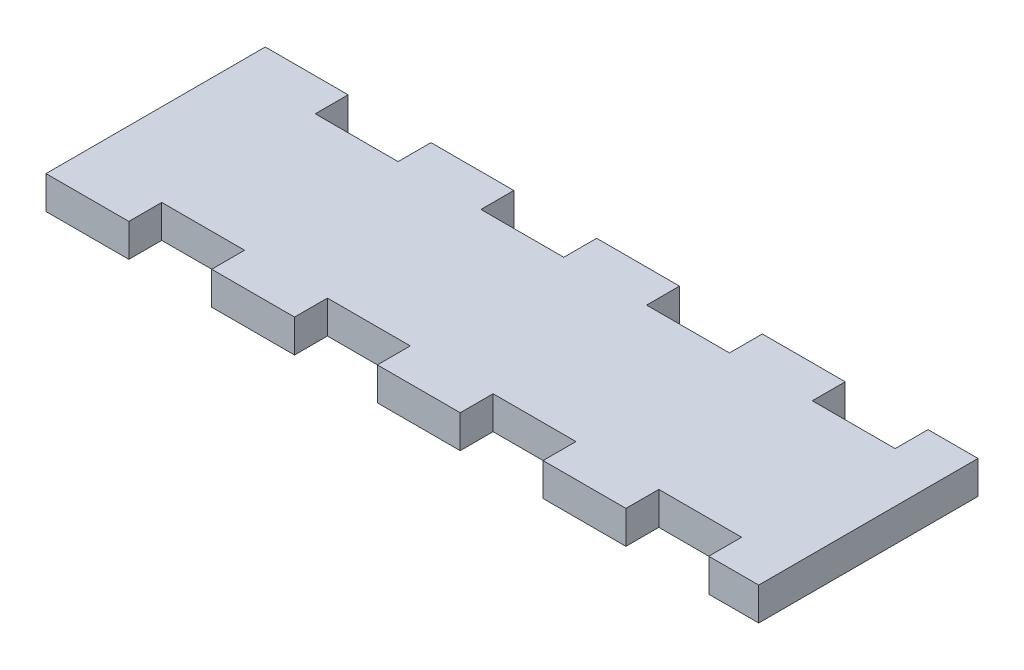
ISO-10303-21;
HEADER;
FILE_DESCRIPTION(('STEP AP214'),'2;1');
FILE_NAME('part.step','',(''),(''),'','','');
FILE_SCHEMA(('AUTOMOTIVE_DESIGN { 1 0 10303 214 1 1 1 1 }'));
ENDSEC;
DATA;
#1=APPLICATION_CONTEXT('core data for automotive mechanical design processes');
#2=APPLICATION_PROTOCOL_DEFINITION('international standard','automotive_design',2000,#1);
#3=PRODUCT_CONTEXT('',#1,'mechanical');
#4=PRODUCT('Part','Part','',(#3));
#5=PRODUCT_RELATED_PRODUCT_CATEGORY('part','',(#4));
#6=PRODUCT_DEFINITION_FORMATION('','',#4);
#7=PRODUCT_DEFINITION_CONTEXT('part definition',#1,'design');
#8=PRODUCT_DEFINITION('design','',#6,#7);
#9=PRODUCT_DEFINITION_SHAPE('','',#8);
#10=(LENGTH_UNIT() NAMED_UNIT(*) SI_UNIT(.MILLI.,.METRE.));
#11=(NAMED_UNIT(*) PLANE_ANGLE_UNIT() SI_UNIT($,.RADIAN.));
#12=(NAMED_UNIT(*) SI_UNIT($,.STERADIAN.) SOLID_ANGLE_UNIT());
#13=UNCERTAINTY_MEASURE_WITH_UNIT(LENGTH_MEASURE(1.E-05),#10,'distance_accuracy_value','');
#14=(GEOMETRIC_REPRESENTATION_CONTEXT(3) GLOBAL_UNCERTAINTY_ASSIGNED_CONTEXT((#13)) GLOBAL_UNIT_ASSIGNED_CONTEXT((#10,
#11,#12)) REPRESENTATION_CONTEXT('',''));
#15=CARTESIAN_POINT('',(0.,0.,0.));
#16=DIRECTION('',(0.,0.,1.));
#17=DIRECTION('',(1.,0.,0.));
#18=AXIS2_PLACEMENT_3D('',#15,#16,#17);
#19=CARTESIAN_POINT('',(0.,3.,0.));
#20=DIRECTION('',(1.,0.,0.));
#21=DIRECTION('',(0.,0.,-1.));
#22=AXIS2_PLACEMENT_3D('',#19,#20,#21);
#23=PLANE('',#22);
#24=DIRECTION('',(0.,0.,1.));
#25=VECTOR('',#24,1.);
#26=CARTESIAN_POINT('',(0.,0.,0.));
#27=LINE('',#26,#25);
#28=CARTESIAN_POINT('',(0.,0.,-20.));
#29=VERTEX_POINT('',#28);
#30=CARTESIAN_POINT('',(0.,0.,0.));
#31=VERTEX_POINT('',#30);
#32=EDGE_CURVE('E296',#29,#31,#27,.T.);
#33=ORIENTED_EDGE('',*,*,#32,.T.);
#34=DIRECTION('',(0.,-1.,0.));
#35=VECTOR('',#34,1.);
#36=CARTESIAN_POINT('',(0.,3.,0.));
#37=LINE('',#36,#35);
#38=CARTESIAN_POINT('',(0.,3.,0.));
#39=VERTEX_POINT('',#38);
#40=EDGE_CURVE('E11',#39,#31,#37,.T.);
#41=ORIENTED_EDGE('',*,*,#40,.F.);
#42=DIRECTION('',(0.,0.,1.));
#43=VECTOR('',#42,1.);
#44=CARTESIAN_POINT('',(0.,3.,0.));
#45=LINE('',#44,#43);
#46=CARTESIAN_POINT('',(0.,3.,-20.));
#47=VERTEX_POINT('',#46);
#48=EDGE_CURVE('E366',#47,#39,#45,.T.);
#49=ORIENTED_EDGE('',*,*,#48,.F.);
#50=DIRECTION('',(0.,-1.,0.));
#51=VECTOR('',#50,1.);
#52=CARTESIAN_POINT('',(0.,3.,-20.));
#53=LINE('',#52,#51);
#54=EDGE_CURVE('E292',#47,#29,#53,.T.);
#55=ORIENTED_EDGE('',*,*,#54,.T.);
#56=EDGE_LOOP('',(#33,#41,#49,#55));
#57=FACE_BOUND('',#56,.T.);
#58=ADVANCED_FACE('F32',(#57),#23,.F.);
#59=CARTESIAN_POINT('',(0.,3.,0.));
#60=DIRECTION('',(0.,0.,-1.));
#61=DIRECTION('',(-1.,0.,0.));
#62=AXIS2_PLACEMENT_3D('',#59,#60,#61);
#63=PLANE('',#62);
#64=DIRECTION('',(1.,0.,0.));
#65=VECTOR('',#64,1.);
#66=CARTESIAN_POINT('',(0.,0.,0.));
#67=LINE('',#66,#65);
#68=CARTESIAN_POINT('',(7.55599199999998,0.,0.));
#69=VERTEX_POINT('',#68);
#70=EDGE_CURVE('E299',#31,#69,#67,.T.);
#71=ORIENTED_EDGE('',*,*,#70,.T.);
#72=DIRECTION('',(0.,-1.,0.));
#73=VECTOR('',#72,1.);
#74=CARTESIAN_POINT('',(7.55599199999998,3.,0.));
#75=LINE('',#74,#73);
#76=CARTESIAN_POINT('',(7.55599199999998,3.,0.));
#77=VERTEX_POINT('',#76);
#78=EDGE_CURVE('E40',#77,#69,#75,.T.);
#79=ORIENTED_EDGE('',*,*,#78,.F.);
#80=DIRECTION('',(1.,0.,0.));
#81=VECTOR('',#80,1.);
#82=CARTESIAN_POINT('',(0.,3.,0.));
#83=LINE('',#82,#81);
#84=EDGE_CURVE('E175',#39,#77,#83,.T.);
#85=ORIENTED_EDGE('',*,*,#84,.F.);
#86=ORIENTED_EDGE('',*,*,#40,.T.);
#87=EDGE_LOOP('',(#71,#79,#85,#86));
#88=FACE_BOUND('',#87,.T.);
#89=ADVANCED_FACE('F564',(#88),#63,.F.);
#90=CARTESIAN_POINT('',(7.55599199999998,3.,-2.99999399999999));
#91=DIRECTION('',(-1.,0.,0.));
#92=DIRECTION('',(0.,0.,1.));
#93=AXIS2_PLACEMENT_3D('',#90,#91,#92);
#94=PLANE('',#93);
#95=DIRECTION('',(0.,0.,-1.));
#96=VECTOR('',#95,1.);
#97=CARTESIAN_POINT('',(7.55599199999998,0.,-2.99999399999999));
#98=LINE('',#97,#96);
#99=CARTESIAN_POINT('',(7.55599199999998,0.,-2.99999399999999));
#100=VERTEX_POINT('',#99);
#101=EDGE_CURVE('E301',#69,#100,#98,.T.);
#102=ORIENTED_EDGE('',*,*,#101,.T.);
#103=DIRECTION('',(0.,-1.,0.));
#104=VECTOR('',#103,1.);
#105=CARTESIAN_POINT('',(7.55599199999998,3.,-2.99999399999999));
#106=LINE('',#105,#104);
#107=CARTESIAN_POINT('',(7.55599199999998,3.,-2.99999399999999));
#108=VERTEX_POINT('',#107);
#109=EDGE_CURVE('E457',#108,#100,#106,.T.);
#110=ORIENTED_EDGE('',*,*,#109,.F.);
#111=DIRECTION('',(0.,0.,-1.));
#112=VECTOR('',#111,1.);
#113=CARTESIAN_POINT('',(7.55599199999998,3.,-2.99999399999999));
#114=LINE('',#113,#112);
#115=EDGE_CURVE('E465',#77,#108,#114,.T.);
#116=ORIENTED_EDGE('',*,*,#115,.F.);
#117=ORIENTED_EDGE('',*,*,#78,.T.);
#118=EDGE_LOOP('',(#102,#110,#116,#117));
#119=FACE_BOUND('',#118,.T.);
#120=ADVANCED_FACE('F463',(#119),#94,.F.);
#121=CARTESIAN_POINT('',(7.55599199999998,3.,-2.99999399999999));
#122=DIRECTION('',(0.,0.,-1.));
#123=DIRECTION('',(-1.,0.,0.));
#124=AXIS2_PLACEMENT_3D('',#121,#122,#123);
#125=PLANE('',#124);
#126=DIRECTION('',(1.,0.,0.));
#127=VECTOR('',#126,1.);
#128=CARTESIAN_POINT('',(7.55599199999998,0.,-2.99999399999999));
#129=LINE('',#128,#127);
#130=CARTESIAN_POINT('',(15.11173,0.,-2.99999399999999));
#131=VERTEX_POINT('',#130);
#132=EDGE_CURVE('E303',#100,#131,#129,.T.);
#133=ORIENTED_EDGE('',*,*,#132,.T.);
#134=DIRECTION('',(0.,-1.,0.));
#135=VECTOR('',#134,1.);
#136=CARTESIAN_POINT('',(15.11173,3.,-2.99999399999999));
#137=LINE('',#136,#135);
#138=CARTESIAN_POINT('',(15.11173,3.,-2.99999399999999));
#139=VERTEX_POINT('',#138);
#140=EDGE_CURVE('E454',#139,#131,#137,.T.);
#141=ORIENTED_EDGE('',*,*,#140,.F.);
#142=DIRECTION('',(1.,0.,0.));
#143=VECTOR('',#142,1.);
#144=CARTESIAN_POINT('',(7.55599199999998,3.,-2.99999399999999));
#145=LINE('',#144,#143);
#146=EDGE_CURVE('E483',#108,#139,#145,.T.);
#147=ORIENTED_EDGE('',*,*,#146,.F.);
#148=ORIENTED_EDGE('',*,*,#109,.T.);
#149=EDGE_LOOP('',(#133,#141,#147,#148));
#150=FACE_BOUND('',#149,.T.);
#151=ADVANCED_FACE('F474',(#150),#125,.F.);
#152=CARTESIAN_POINT('',(15.11173,3.,-2.99999399999999));
#153=DIRECTION('',(1.,0.,0.));
#154=DIRECTION('',(0.,0.,-1.));
#155=AXIS2_PLACEMENT_3D('',#152,#153,#154);
#156=PLANE('',#155);
#157=DIRECTION('',(0.,0.,1.));
#158=VECTOR('',#157,1.);
#159=CARTESIAN_POINT('',(15.11173,0.,-2.99999399999999));
#160=LINE('',#159,#158);
#161=CARTESIAN_POINT('',(15.11173,0.,0.));
#162=VERTEX_POINT('',#161);
#163=EDGE_CURVE('E305',#131,#162,#160,.T.);
#164=ORIENTED_EDGE('',*,*,#163,.T.);
#165=DIRECTION('',(0.,-1.,0.));
#166=VECTOR('',#165,1.);
#167=CARTESIAN_POINT('',(15.11173,3.,0.));
#168=LINE('',#167,#166);
#169=CARTESIAN_POINT('',(15.11173,3.,0.));
#170=VERTEX_POINT('',#169);
#171=EDGE_CURVE('E451',#170,#162,#168,.T.);
#172=ORIENTED_EDGE('',*,*,#171,.F.);
#173=DIRECTION('',(0.,0.,1.));
#174=VECTOR('',#173,1.);
#175=CARTESIAN_POINT('',(15.11173,3.,-2.99999399999999));
#176=LINE('',#175,#174);
#177=EDGE_CURVE('E480',#139,#170,#176,.T.);
#178=ORIENTED_EDGE('',*,*,#177,.F.);
#179=ORIENTED_EDGE('',*,*,#140,.T.);
#180=EDGE_LOOP('',(#164,#172,#178,#179));
#181=FACE_BOUND('',#180,.T.);
#182=ADVANCED_FACE('F478',(#181),#156,.F.);
#183=CARTESIAN_POINT('',(15.11173,3.,0.));
#184=DIRECTION('',(0.,0.,-1.));
#185=DIRECTION('',(-1.,0.,0.));
#186=AXIS2_PLACEMENT_3D('',#183,#184,#185);
#187=PLANE('',#186);
#188=DIRECTION('',(1.,0.,0.));
#189=VECTOR('',#188,1.);
#190=CARTESIAN_POINT('',(15.11173,0.,0.));
#191=LINE('',#190,#189);
#192=CARTESIAN_POINT('',(22.667468,0.,0.));
#193=VERTEX_POINT('',#192);
#194=EDGE_CURVE('E307',#162,#193,#191,.T.);
#195=ORIENTED_EDGE('',*,*,#194,.T.);
#196=DIRECTION('',(0.,-1.,0.));
#197=VECTOR('',#196,1.);
#198=CARTESIAN_POINT('',(22.667468,3.,0.));
#199=LINE('',#198,#197);
#200=CARTESIAN_POINT('',(22.667468,3.,0.));
#201=VERTEX_POINT('',#200);
#202=EDGE_CURVE('E448',#201,#193,#199,.T.);
#203=ORIENTED_EDGE('',*,*,#202,.F.);
#204=DIRECTION('',(1.,0.,0.));
#205=VECTOR('',#204,1.);
#206=CARTESIAN_POINT('',(15.11173,3.,0.));
#207=LINE('',#206,#205);
#208=EDGE_CURVE('E482',#170,#201,#207,.T.);
#209=ORIENTED_EDGE('',*,*,#208,.F.);
#210=ORIENTED_EDGE('',*,*,#171,.T.);
#211=EDGE_LOOP('',(#195,#203,#209,#210));
#212=FACE_BOUND('',#211,.T.);
#213=ADVANCED_FACE('F577',(#212),#187,.F.);
#214=CARTESIAN_POINT('',(22.667468,3.,-2.99999399999999));
#215=DIRECTION('',(-1.,0.,0.));
#216=DIRECTION('',(0.,0.,1.));
#217=AXIS2_PLACEMENT_3D('',#214,#215,#216);
#218=PLANE('',#217);
#219=DIRECTION('',(0.,0.,-1.));
#220=VECTOR('',#219,1.);
#221=CARTESIAN_POINT('',(22.667468,0.,-2.99999399999999));
#222=LINE('',#221,#220);
#223=CARTESIAN_POINT('',(22.667468,0.,-2.99999399999999));
#224=VERTEX_POINT('',#223);
#225=EDGE_CURVE('E309',#193,#224,#222,.T.);
#226=ORIENTED_EDGE('',*,*,#225,.T.);
#227=DIRECTION('',(0.,-1.,0.));
#228=VECTOR('',#227,1.);
#229=CARTESIAN_POINT('',(22.667468,3.,-2.99999399999999));
#230=LINE('',#229,#228);
#231=CARTESIAN_POINT('',(22.667468,3.,-2.99999399999999));
#232=VERTEX_POINT('',#231);
#233=EDGE_CURVE('E445',#232,#224,#230,.T.);
#234=ORIENTED_EDGE('',*,*,#233,.F.);
#235=DIRECTION('',(0.,0.,-1.));
#236=VECTOR('',#235,1.);
#237=CARTESIAN_POINT('',(22.667468,3.,-2.99999399999999));
#238=LINE('',#237,#236);
#239=EDGE_CURVE('E485',#201,#232,#238,.T.);
#240=ORIENTED_EDGE('',*,*,#239,.F.);
#241=ORIENTED_EDGE('',*,*,#202,.T.);
#242=EDGE_LOOP('',(#226,#234,#240,#241));
#243=FACE_BOUND('',#242,.T.);
#244=ADVANCED_FACE('F580',(#243),#218,.F.);
#245=CARTESIAN_POINT('',(22.667468,3.,-2.99999399999999));
#246=DIRECTION('',(0.,0.,-1.));
#247=DIRECTION('',(-1.,0.,0.));
#248=AXIS2_PLACEMENT_3D('',#245,#246,#247);
#249=PLANE('',#248);
#250=DIRECTION('',(1.,0.,0.));
#251=VECTOR('',#250,1.);
#252=CARTESIAN_POINT('',(22.667468,0.,-2.99999399999999));
#253=LINE('',#252,#251);
#254=CARTESIAN_POINT('',(30.221936,0.,-2.99999399999999));
#255=VERTEX_POINT('',#254);
#256=EDGE_CURVE('E311',#224,#255,#253,.T.);
#257=ORIENTED_EDGE('',*,*,#256,.T.);
#258=DIRECTION('',(0.,-1.,0.));
#259=VECTOR('',#258,1.);
#260=CARTESIAN_POINT('',(30.221936,3.,-2.99999399999999));
#261=LINE('',#260,#259);
#262=CARTESIAN_POINT('',(30.221936,3.,-2.99999399999999));
#263=VERTEX_POINT('',#262);
#264=EDGE_CURVE('E442',#263,#255,#261,.T.);
#265=ORIENTED_EDGE('',*,*,#264,.F.);
#266=DIRECTION('',(1.,0.,0.));
#267=VECTOR('',#266,1.);
#268=CARTESIAN_POINT('',(22.667468,3.,-2.99999399999999));
#269=LINE('',#268,#267);
#270=EDGE_CURVE('E491',#232,#263,#269,.T.);
#271=ORIENTED_EDGE('',*,*,#270,.F.);
#272=ORIENTED_EDGE('',*,*,#233,.T.);
#273=EDGE_LOOP('',(#257,#265,#271,#272));
#274=FACE_BOUND('',#273,.T.);
#275=ADVANCED_FACE('F584',(#274),#249,.F.);
#276=CARTESIAN_POINT('',(30.221936,3.,-2.99999399999999));
#277=DIRECTION('',(1.,0.,0.));
#278=DIRECTION('',(0.,0.,-1.));
#279=AXIS2_PLACEMENT_3D('',#276,#277,#278);
#280=PLANE('',#279);
#281=DIRECTION('',(0.,0.,1.));
#282=VECTOR('',#281,1.);
#283=CARTESIAN_POINT('',(30.221936,0.,-2.99999399999999));
#284=LINE('',#283,#282);
#285=CARTESIAN_POINT('',(30.221936,0.,0.));
#286=VERTEX_POINT('',#285);
#287=EDGE_CURVE('E313',#255,#286,#284,.T.);
#288=ORIENTED_EDGE('',*,*,#287,.T.);
#289=DIRECTION('',(0.,-1.,0.));
#290=VECTOR('',#289,1.);
#291=CARTESIAN_POINT('',(30.221936,3.,0.));
#292=LINE('',#291,#290);
#293=CARTESIAN_POINT('',(30.221936,3.,0.));
#294=VERTEX_POINT('',#293);
#295=EDGE_CURVE('E439',#294,#286,#292,.T.);
#296=ORIENTED_EDGE('',*,*,#295,.F.);
#297=DIRECTION('',(0.,0.,1.));
#298=VECTOR('',#297,1.);
#299=CARTESIAN_POINT('',(30.221936,3.,-2.99999399999999));
#300=LINE('',#299,#298);
#301=EDGE_CURVE('E493',#263,#294,#300,.T.);
#302=ORIENTED_EDGE('',*,*,#301,.F.);
#303=ORIENTED_EDGE('',*,*,#264,.T.);
#304=EDGE_LOOP('',(#288,#296,#302,#303));
#305=FACE_BOUND('',#304,.T.);
#306=ADVANCED_FACE('F588',(#305),#280,.F.);
#307=CARTESIAN_POINT('',(30.221936,3.,0.));
#308=DIRECTION('',(0.,0.,-1.));
#309=DIRECTION('',(-1.,0.,0.));
#310=AXIS2_PLACEMENT_3D('',#307,#308,#309);
#311=PLANE('',#310);
#312=DIRECTION('',(1.,0.,0.));
#313=VECTOR('',#312,1.);
#314=CARTESIAN_POINT('',(30.221936,0.,0.));
#315=LINE('',#314,#313);
#316=CARTESIAN_POINT('',(37.777674,0.,0.));
#317=VERTEX_POINT('',#316);
#318=EDGE_CURVE('E315',#286,#317,#315,.T.);
#319=ORIENTED_EDGE('',*,*,#318,.T.);
#320=DIRECTION('',(0.,-1.,0.));
#321=VECTOR('',#320,1.);
#322=CARTESIAN_POINT('',(37.777674,3.,0.));
#323=LINE('',#322,#321);
#324=CARTESIAN_POINT('',(37.777674,3.,0.));
#325=VERTEX_POINT('',#324);
#326=EDGE_CURVE('E436',#325,#317,#323,.T.);
#327=ORIENTED_EDGE('',*,*,#326,.F.);
#328=DIRECTION('',(1.,0.,0.));
#329=VECTOR('',#328,1.);
#330=CARTESIAN_POINT('',(30.221936,3.,0.));
#331=LINE('',#330,#329);
#332=EDGE_CURVE('E495',#294,#325,#331,.T.);
#333=ORIENTED_EDGE('',*,*,#332,.F.);
#334=ORIENTED_EDGE('',*,*,#295,.T.);
#335=EDGE_LOOP('',(#319,#327,#333,#334));
#336=FACE_BOUND('',#335,.T.);
#337=ADVANCED_FACE('F592',(#336),#311,.F.);
#338=CARTESIAN_POINT('',(37.777674,3.,-2.99999399999999));
#339=DIRECTION('',(-1.,0.,0.));
#340=DIRECTION('',(0.,0.,1.));
#341=AXIS2_PLACEMENT_3D('',#338,#339,#340);
#342=PLANE('',#341);
#343=DIRECTION('',(0.,0.,-1.));
#344=VECTOR('',#343,1.);
#345=CARTESIAN_POINT('',(37.777674,0.,-2.99999399999999));
#346=LINE('',#345,#344);
#347=CARTESIAN_POINT('',(37.777674,0.,-2.99999399999999));
#348=VERTEX_POINT('',#347);
#349=EDGE_CURVE('E317',#317,#348,#346,.T.);
#350=ORIENTED_EDGE('',*,*,#349,.T.);
#351=DIRECTION('',(0.,-1.,0.));
#352=VECTOR('',#351,1.);
#353=CARTESIAN_POINT('',(37.777674,3.,-2.99999399999999));
#354=LINE('',#353,#352);
#355=CARTESIAN_POINT('',(37.777674,3.,-2.99999399999999));
#356=VERTEX_POINT('',#355);
#357=EDGE_CURVE('E433',#356,#348,#354,.T.);
#358=ORIENTED_EDGE('',*,*,#357,.F.);
#359=DIRECTION('',(0.,0.,-1.));
#360=VECTOR('',#359,1.);
#361=CARTESIAN_POINT('',(37.777674,3.,-2.99999399999999));
#362=LINE('',#361,#360);
#363=EDGE_CURVE('E497',#325,#356,#362,.T.);
#364=ORIENTED_EDGE('',*,*,#363,.F.);
#365=ORIENTED_EDGE('',*,*,#326,.T.);
#366=EDGE_LOOP('',(#350,#358,#364,#365));
#367=FACE_BOUND('',#366,.T.);
#368=ADVANCED_FACE('F596',(#367),#342,.F.);
#369=CARTESIAN_POINT('',(37.777674,3.,-2.99999399999999));
#370=DIRECTION('',(0.,0.,-1.));
#371=DIRECTION('',(-1.,0.,0.));
#372=AXIS2_PLACEMENT_3D('',#369,#370,#371);
#373=PLANE('',#372);
#374=DIRECTION('',(1.,0.,0.));
#375=VECTOR('',#374,1.);
#376=CARTESIAN_POINT('',(37.777674,0.,-2.99999399999999));
#377=LINE('',#376,#375);
#378=CARTESIAN_POINT('',(45.333412,0.,-2.99999399999999));
#379=VERTEX_POINT('',#378);
#380=EDGE_CURVE('E319',#348,#379,#377,.T.);
#381=ORIENTED_EDGE('',*,*,#380,.T.);
#382=DIRECTION('',(0.,-1.,0.));
#383=VECTOR('',#382,1.);
#384=CARTESIAN_POINT('',(45.333412,3.,-2.99999399999999));
#385=LINE('',#384,#383);
#386=CARTESIAN_POINT('',(45.333412,3.,-2.99999399999999));
#387=VERTEX_POINT('',#386);
#388=EDGE_CURVE('E430',#387,#379,#385,.T.);
#389=ORIENTED_EDGE('',*,*,#388,.F.);
#390=DIRECTION('',(1.,0.,0.));
#391=VECTOR('',#390,1.);
#392=CARTESIAN_POINT('',(37.777674,3.,-2.99999399999999));
#393=LINE('',#392,#391);
#394=EDGE_CURVE('E499',#356,#387,#393,.T.);
#395=ORIENTED_EDGE('',*,*,#394,.F.);
#396=ORIENTED_EDGE('',*,*,#357,.T.);
#397=EDGE_LOOP('',(#381,#389,#395,#396));
#398=FACE_BOUND('',#397,.T.);
#399=ADVANCED_FACE('F600',(#398),#373,.F.);
#400=CARTESIAN_POINT('',(45.333412,3.,-2.99999399999999));
#401=DIRECTION('',(1.,0.,0.));
#402=DIRECTION('',(0.,0.,-1.));
#403=AXIS2_PLACEMENT_3D('',#400,#401,#402);
#404=PLANE('',#403);
#405=DIRECTION('',(0.,0.,1.));
#406=VECTOR('',#405,1.);
#407=CARTESIAN_POINT('',(45.333412,0.,-2.99999399999999));
#408=LINE('',#407,#406);
#409=CARTESIAN_POINT('',(45.333412,0.,0.));
#410=VERTEX_POINT('',#409);
#411=EDGE_CURVE('E321',#379,#410,#408,.T.);
#412=ORIENTED_EDGE('',*,*,#411,.T.);
#413=DIRECTION('',(0.,-1.,0.));
#414=VECTOR('',#413,1.);
#415=CARTESIAN_POINT('',(45.333412,3.,0.));
#416=LINE('',#415,#414);
#417=CARTESIAN_POINT('',(45.333412,3.,0.));
#418=VERTEX_POINT('',#417);
#419=EDGE_CURVE('E427',#418,#410,#416,.T.);
#420=ORIENTED_EDGE('',*,*,#419,.F.);
#421=DIRECTION('',(0.,0.,1.));
#422=VECTOR('',#421,1.);
#423=CARTESIAN_POINT('',(45.333412,3.,-2.99999399999999));
#424=LINE('',#423,#422);
#425=EDGE_CURVE('E501',#387,#418,#424,.T.);
#426=ORIENTED_EDGE('',*,*,#425,.F.);
#427=ORIENTED_EDGE('',*,*,#388,.T.);
#428=EDGE_LOOP('',(#412,#420,#426,#427));
#429=FACE_BOUND('',#428,.T.);
#430=ADVANCED_FACE('F604',(#429),#404,.F.);
#431=CARTESIAN_POINT('',(45.333412,3.,0.));
#432=DIRECTION('',(0.,0.,-1.));
#433=DIRECTION('',(-1.,0.,0.));
#434=AXIS2_PLACEMENT_3D('',#431,#432,#433);
#435=PLANE('',#434);
#436=DIRECTION('',(1.,0.,0.));
#437=VECTOR('',#436,1.);
#438=CARTESIAN_POINT('',(45.333412,0.,0.));
#439=LINE('',#438,#437);
#440=CARTESIAN_POINT('',(52.88915,0.,0.));
#441=VERTEX_POINT('',#440);
#442=EDGE_CURVE('E323',#410,#441,#439,.T.);
#443=ORIENTED_EDGE('',*,*,#442,.T.);
#444=DIRECTION('',(0.,-1.,0.));
#445=VECTOR('',#444,1.);
#446=CARTESIAN_POINT('',(52.88915,3.,0.));
#447=LINE('',#446,#445);
#448=CARTESIAN_POINT('',(52.88915,3.,0.));
#449=VERTEX_POINT('',#448);
#450=EDGE_CURVE('E424',#449,#441,#447,.T.);
#451=ORIENTED_EDGE('',*,*,#450,.F.);
#452=DIRECTION('',(1.,0.,0.));
#453=VECTOR('',#452,1.);
#454=CARTESIAN_POINT('',(45.333412,3.,0.));
#455=LINE('',#454,#453);
#456=EDGE_CURVE('E503',#418,#449,#455,.T.);
#457=ORIENTED_EDGE('',*,*,#456,.F.);
#458=ORIENTED_EDGE('',*,*,#419,.T.);
#459=EDGE_LOOP('',(#443,#451,#457,#458));
#460=FACE_BOUND('',#459,.T.);
#461=ADVANCED_FACE('F608',(#460),#435,.F.);
#462=CARTESIAN_POINT('',(52.88915,3.,-2.99999399999999));
#463=DIRECTION('',(-1.,0.,0.));
#464=DIRECTION('',(0.,0.,1.));
#465=AXIS2_PLACEMENT_3D('',#462,#463,#464);
#466=PLANE('',#465);
#467=DIRECTION('',(0.,0.,-1.));
#468=VECTOR('',#467,1.);
#469=CARTESIAN_POINT('',(52.88915,0.,-2.99999399999999));
#470=LINE('',#469,#468);
#471=CARTESIAN_POINT('',(52.88915,0.,-2.99999399999999));
#472=VERTEX_POINT('',#471);
#473=EDGE_CURVE('E325',#441,#472,#470,.T.);
#474=ORIENTED_EDGE('',*,*,#473,.T.);
#475=DIRECTION('',(0.,-1.,0.));
#476=VECTOR('',#475,1.);
#477=CARTESIAN_POINT('',(52.88915,3.,-2.99999399999999));
#478=LINE('',#477,#476);
#479=CARTESIAN_POINT('',(52.88915,3.,-2.99999399999999));
#480=VERTEX_POINT('',#479);
#481=EDGE_CURVE('E421',#480,#472,#478,.T.);
#482=ORIENTED_EDGE('',*,*,#481,.F.);
#483=DIRECTION('',(0.,0.,-1.));
#484=VECTOR('',#483,1.);
#485=CARTESIAN_POINT('',(52.88915,3.,-2.99999399999999));
#486=LINE('',#485,#484);
#487=EDGE_CURVE('E505',#449,#480,#486,.T.);
#488=ORIENTED_EDGE('',*,*,#487,.F.);
#489=ORIENTED_EDGE('',*,*,#450,.T.);
#490=EDGE_LOOP('',(#474,#482,#488,#489));
#491=FACE_BOUND('',#490,.T.);
#492=ADVANCED_FACE('F612',(#491),#466,.F.);
#493=CARTESIAN_POINT('',(52.88915,3.,-2.99999399999999));
#494=DIRECTION('',(0.,0.,-1.));
#495=DIRECTION('',(-1.,0.,0.));
#496=AXIS2_PLACEMENT_3D('',#493,#494,#495);
#497=PLANE('',#496);
#498=DIRECTION('',(1.,0.,0.));
#499=VECTOR('',#498,1.);
#500=CARTESIAN_POINT('',(52.88915,0.,-2.99999399999999));
#501=LINE('',#500,#499);
#502=CARTESIAN_POINT('',(60.444634,0.,-2.99999399999999));
#503=VERTEX_POINT('',#502);
#504=EDGE_CURVE('E327',#472,#503,#501,.T.);
#505=ORIENTED_EDGE('',*,*,#504,.T.);
#506=DIRECTION('',(0.,-1.,0.));
#507=VECTOR('',#506,1.);
#508=CARTESIAN_POINT('',(60.444634,3.,-2.99999399999999));
#509=LINE('',#508,#507);
#510=CARTESIAN_POINT('',(60.444634,3.,-2.99999399999999));
#511=VERTEX_POINT('',#510);
#512=EDGE_CURVE('E418',#511,#503,#509,.T.);
#513=ORIENTED_EDGE('',*,*,#512,.F.);
#514=DIRECTION('',(1.,0.,0.));
#515=VECTOR('',#514,1.);
#516=CARTESIAN_POINT('',(52.88915,3.,-2.99999399999999));
#517=LINE('',#516,#515);
#518=EDGE_CURVE('E507',#480,#511,#517,.T.);
#519=ORIENTED_EDGE('',*,*,#518,.F.);
#520=ORIENTED_EDGE('',*,*,#481,.T.);
#521=EDGE_LOOP('',(#505,#513,#519,#520));
#522=FACE_BOUND('',#521,.T.);
#523=ADVANCED_FACE('F616',(#522),#497,.F.);
#524=CARTESIAN_POINT('',(60.444634,3.,-2.99999399999999));
#525=DIRECTION('',(1.,0.,0.));
#526=DIRECTION('',(0.,0.,-1.));
#527=AXIS2_PLACEMENT_3D('',#524,#525,#526);
#528=PLANE('',#527);
#529=DIRECTION('',(0.,0.,1.));
#530=VECTOR('',#529,1.);
#531=CARTESIAN_POINT('',(60.444634,0.,-2.99999399999999));
#532=LINE('',#531,#530);
#533=CARTESIAN_POINT('',(60.444634,0.,0.));
#534=VERTEX_POINT('',#533);
#535=EDGE_CURVE('E329',#503,#534,#532,.T.);
#536=ORIENTED_EDGE('',*,*,#535,.T.);
#537=DIRECTION('',(0.,-1.,0.));
#538=VECTOR('',#537,1.);
#539=CARTESIAN_POINT('',(60.444634,3.,0.));
#540=LINE('',#539,#538);
#541=CARTESIAN_POINT('',(60.444634,3.,0.));
#542=VERTEX_POINT('',#541);
#543=EDGE_CURVE('E415',#542,#534,#540,.T.);
#544=ORIENTED_EDGE('',*,*,#543,.F.);
#545=DIRECTION('',(0.,0.,1.));
#546=VECTOR('',#545,1.);
#547=CARTESIAN_POINT('',(60.444634,3.,-2.99999399999999));
#548=LINE('',#547,#546);
#549=EDGE_CURVE('E509',#511,#542,#548,.T.);
#550=ORIENTED_EDGE('',*,*,#549,.F.);
#551=ORIENTED_EDGE('',*,*,#512,.T.);
#552=EDGE_LOOP('',(#536,#544,#550,#551));
#553=FACE_BOUND('',#552,.T.);
#554=ADVANCED_FACE('F620',(#553),#528,.F.);
#555=CARTESIAN_POINT('',(60.444634,3.,0.));
#556=DIRECTION('',(0.,0.,-1.));
#557=DIRECTION('',(-1.,0.,0.));
#558=AXIS2_PLACEMENT_3D('',#555,#556,#557);
#559=PLANE('',#558);
#560=DIRECTION('',(1.,0.,0.));
#561=VECTOR('',#560,1.);
#562=CARTESIAN_POINT('',(60.444634,0.,0.));
#563=LINE('',#562,#561);
#564=CARTESIAN_POINT('',(65.000886,0.,0.));
#565=VERTEX_POINT('',#564);
#566=EDGE_CURVE('E331',#534,#565,#563,.T.);
#567=ORIENTED_EDGE('',*,*,#566,.T.);
#568=DIRECTION('',(0.,-1.,0.));
#569=VECTOR('',#568,1.);
#570=CARTESIAN_POINT('',(65.000886,3.,0.));
#571=LINE('',#570,#569);
#572=CARTESIAN_POINT('',(65.000886,3.,0.));
#573=VERTEX_POINT('',#572);
#574=EDGE_CURVE('E412',#573,#565,#571,.T.);
#575=ORIENTED_EDGE('',*,*,#574,.F.);
#576=DIRECTION('',(1.,0.,0.));
#577=VECTOR('',#576,1.);
#578=CARTESIAN_POINT('',(60.444634,3.,0.));
#579=LINE('',#578,#577);
#580=EDGE_CURVE('E511',#542,#573,#579,.T.);
#581=ORIENTED_EDGE('',*,*,#580,.F.);
#582=ORIENTED_EDGE('',*,*,#543,.T.);
#583=EDGE_LOOP('',(#567,#575,#581,#582));
#584=FACE_BOUND('',#583,.T.);
#585=ADVANCED_FACE('F624',(#584),#559,.F.);
#586=CARTESIAN_POINT('',(65.000886,3.,0.));
#587=DIRECTION('',(-1.,0.,0.));
#588=DIRECTION('',(0.,0.,1.));
#589=AXIS2_PLACEMENT_3D('',#586,#587,#588);
#590=PLANE('',#589);
#591=DIRECTION('',(0.,0.,-1.));
#592=VECTOR('',#591,1.);
#593=CARTESIAN_POINT('',(65.000886,0.,0.));
#594=LINE('',#593,#592);
#595=CARTESIAN_POINT('',(65.000886,0.,-20.));
#596=VERTEX_POINT('',#595);
#597=EDGE_CURVE('E333',#565,#596,#594,.T.);
#598=ORIENTED_EDGE('',*,*,#597,.T.);
#599=DIRECTION('',(0.,-1.,0.));
#600=VECTOR('',#599,1.);
#601=CARTESIAN_POINT('',(65.000886,3.,-20.));
#602=LINE('',#601,#600);
#603=CARTESIAN_POINT('',(65.000886,3.,-20.));
#604=VERTEX_POINT('',#603);
#605=EDGE_CURVE('E409',#604,#596,#602,.T.);
#606=ORIENTED_EDGE('',*,*,#605,.F.);
#607=DIRECTION('',(0.,0.,-1.));
#608=VECTOR('',#607,1.);
#609=CARTESIAN_POINT('',(65.000886,3.,0.));
#610=LINE('',#609,#608);
#611=EDGE_CURVE('E513',#573,#604,#610,.T.);
#612=ORIENTED_EDGE('',*,*,#611,.F.);
#613=ORIENTED_EDGE('',*,*,#574,.T.);
#614=EDGE_LOOP('',(#598,#606,#612,#613));
#615=FACE_BOUND('',#614,.T.);
#616=ADVANCED_FACE('F628',(#615),#590,.F.);
#617=CARTESIAN_POINT('',(60.444634,3.,-20.));
#618=DIRECTION('',(0.,0.,1.));
#619=DIRECTION('',(1.,0.,0.));
#620=AXIS2_PLACEMENT_3D('',#617,#618,#619);
#621=PLANE('',#620);
#622=DIRECTION('',(-1.,0.,0.));
#623=VECTOR('',#622,1.);
#624=CARTESIAN_POINT('',(60.444634,0.,-20.));
#625=LINE('',#624,#623);
#626=CARTESIAN_POINT('',(60.444634,0.,-20.));
#627=VERTEX_POINT('',#626);
#628=EDGE_CURVE('E335',#596,#627,#625,.T.);
#629=ORIENTED_EDGE('',*,*,#628,.T.);
#630=DIRECTION('',(0.,-1.,0.));
#631=VECTOR('',#630,1.);
#632=CARTESIAN_POINT('',(60.444634,3.,-20.));
#633=LINE('',#632,#631);
#634=CARTESIAN_POINT('',(60.444634,3.,-20.));
#635=VERTEX_POINT('',#634);
#636=EDGE_CURVE('E406',#635,#627,#633,.T.);
#637=ORIENTED_EDGE('',*,*,#636,.F.);
#638=DIRECTION('',(-1.,0.,0.));
#639=VECTOR('',#638,1.);
#640=CARTESIAN_POINT('',(60.444634,3.,-20.));
#641=LINE('',#640,#639);
#642=EDGE_CURVE('E515',#604,#635,#641,.T.);
#643=ORIENTED_EDGE('',*,*,#642,.F.);
#644=ORIENTED_EDGE('',*,*,#605,.T.);
#645=EDGE_LOOP('',(#629,#637,#643,#644));
#646=FACE_BOUND('',#645,.T.);
#647=ADVANCED_FACE('F632',(#646),#621,.F.);
#648=CARTESIAN_POINT('',(60.444634,3.,-20.));
#649=DIRECTION('',(1.,0.,0.));
#650=DIRECTION('',(0.,0.,-1.));
#651=AXIS2_PLACEMENT_3D('',#648,#649,#650);
#652=PLANE('',#651);
#653=DIRECTION('',(0.,0.,1.));
#654=VECTOR('',#653,1.);
#655=CARTESIAN_POINT('',(60.444634,0.,-20.));
#656=LINE('',#655,#654);
#657=CARTESIAN_POINT('',(60.444634,0.,-17.000006));
#658=VERTEX_POINT('',#657);
#659=EDGE_CURVE('E337',#627,#658,#656,.T.);
#660=ORIENTED_EDGE('',*,*,#659,.T.);
#661=DIRECTION('',(0.,-1.,0.));
#662=VECTOR('',#661,1.);
#663=CARTESIAN_POINT('',(60.444634,3.,-17.000006));
#664=LINE('',#663,#662);
#665=CARTESIAN_POINT('',(60.444634,3.,-17.000006));
#666=VERTEX_POINT('',#665);
#667=EDGE_CURVE('E403',#666,#658,#664,.T.);
#668=ORIENTED_EDGE('',*,*,#667,.F.);
#669=DIRECTION('',(0.,0.,1.));
#670=VECTOR('',#669,1.);
#671=CARTESIAN_POINT('',(60.444634,3.,-20.));
#672=LINE('',#671,#670);
#673=EDGE_CURVE('E517',#635,#666,#672,.T.);
#674=ORIENTED_EDGE('',*,*,#673,.F.);
#675=ORIENTED_EDGE('',*,*,#636,.T.);
#676=EDGE_LOOP('',(#660,#668,#674,#675));
#677=FACE_BOUND('',#676,.T.);
#678=ADVANCED_FACE('F636',(#677),#652,.F.);
#679=CARTESIAN_POINT('',(52.88915,3.,-17.000006));
#680=DIRECTION('',(0.,0.,1.));
#681=DIRECTION('',(1.,0.,0.));
#682=AXIS2_PLACEMENT_3D('',#679,#680,#681);
#683=PLANE('',#682);
#684=DIRECTION('',(-1.,0.,0.));
#685=VECTOR('',#684,1.);
#686=CARTESIAN_POINT('',(52.88915,0.,-17.000006));
#687=LINE('',#686,#685);
#688=CARTESIAN_POINT('',(52.88915,0.,-17.000006));
#689=VERTEX_POINT('',#688);
#690=EDGE_CURVE('E339',#658,#689,#687,.T.);
#691=ORIENTED_EDGE('',*,*,#690,.T.);
#692=DIRECTION('',(0.,-1.,0.));
#693=VECTOR('',#692,1.);
#694=CARTESIAN_POINT('',(52.88915,3.,-17.000006));
#695=LINE('',#694,#693);
#696=CARTESIAN_POINT('',(52.88915,3.,-17.000006));
#697=VERTEX_POINT('',#696);
#698=EDGE_CURVE('E400',#697,#689,#695,.T.);
#699=ORIENTED_EDGE('',*,*,#698,.F.);
#700=DIRECTION('',(-1.,0.,0.));
#701=VECTOR('',#700,1.);
#702=CARTESIAN_POINT('',(52.88915,3.,-17.000006));
#703=LINE('',#702,#701);
#704=EDGE_CURVE('E519',#666,#697,#703,.T.);
#705=ORIENTED_EDGE('',*,*,#704,.F.);
#706=ORIENTED_EDGE('',*,*,#667,.T.);
#707=EDGE_LOOP('',(#691,#699,#705,#706));
#708=FACE_BOUND('',#707,.T.);
#709=ADVANCED_FACE('F640',(#708),#683,.F.);
#710=CARTESIAN_POINT('',(52.88915,3.,-20.));
#711=DIRECTION('',(-1.,0.,0.));
#712=DIRECTION('',(0.,0.,1.));
#713=AXIS2_PLACEMENT_3D('',#710,#711,#712);
#714=PLANE('',#713);
#715=DIRECTION('',(0.,0.,-1.));
#716=VECTOR('',#715,1.);
#717=CARTESIAN_POINT('',(52.88915,0.,-20.));
#718=LINE('',#717,#716);
#719=CARTESIAN_POINT('',(52.88915,0.,-20.));
#720=VERTEX_POINT('',#719);
#721=EDGE_CURVE('E341',#689,#720,#718,.T.);
#722=ORIENTED_EDGE('',*,*,#721,.T.);
#723=DIRECTION('',(0.,-1.,0.));
#724=VECTOR('',#723,1.);
#725=CARTESIAN_POINT('',(52.88915,3.,-20.));
#726=LINE('',#725,#724);
#727=CARTESIAN_POINT('',(52.88915,3.,-20.));
#728=VERTEX_POINT('',#727);
#729=EDGE_CURVE('E397',#728,#720,#726,.T.);
#730=ORIENTED_EDGE('',*,*,#729,.F.);
#731=DIRECTION('',(0.,0.,-1.));
#732=VECTOR('',#731,1.);
#733=CARTESIAN_POINT('',(52.88915,3.,-20.));
#734=LINE('',#733,#732);
#735=EDGE_CURVE('E521',#697,#728,#734,.T.);
#736=ORIENTED_EDGE('',*,*,#735,.F.);
#737=ORIENTED_EDGE('',*,*,#698,.T.);
#738=EDGE_LOOP('',(#722,#730,#736,#737));
#739=FACE_BOUND('',#738,.T.);
#740=ADVANCED_FACE('F644',(#739),#714,.F.);
#741=CARTESIAN_POINT('',(45.333412,3.,-20.));
#742=DIRECTION('',(0.,0.,1.));
#743=DIRECTION('',(1.,0.,0.));
#744=AXIS2_PLACEMENT_3D('',#741,#742,#743);
#745=PLANE('',#744);
#746=DIRECTION('',(-1.,0.,0.));
#747=VECTOR('',#746,1.);
#748=CARTESIAN_POINT('',(45.333412,0.,-20.));
#749=LINE('',#748,#747);
#750=CARTESIAN_POINT('',(45.333412,0.,-20.));
#751=VERTEX_POINT('',#750);
#752=EDGE_CURVE('E343',#720,#751,#749,.T.);
#753=ORIENTED_EDGE('',*,*,#752,.T.);
#754=DIRECTION('',(0.,-1.,0.));
#755=VECTOR('',#754,1.);
#756=CARTESIAN_POINT('',(45.333412,3.,-20.));
#757=LINE('',#756,#755);
#758=CARTESIAN_POINT('',(45.333412,3.,-20.));
#759=VERTEX_POINT('',#758);
#760=EDGE_CURVE('E394',#759,#751,#757,.T.);
#761=ORIENTED_EDGE('',*,*,#760,.F.);
#762=DIRECTION('',(-1.,0.,0.));
#763=VECTOR('',#762,1.);
#764=CARTESIAN_POINT('',(45.333412,3.,-20.));
#765=LINE('',#764,#763);
#766=EDGE_CURVE('E523',#728,#759,#765,.T.);
#767=ORIENTED_EDGE('',*,*,#766,.F.);
#768=ORIENTED_EDGE('',*,*,#729,.T.);
#769=EDGE_LOOP('',(#753,#761,#767,#768));
#770=FACE_BOUND('',#769,.T.);
#771=ADVANCED_FACE('F648',(#770),#745,.F.);
#772=CARTESIAN_POINT('',(45.333412,3.,-20.));
#773=DIRECTION('',(1.,0.,0.));
#774=DIRECTION('',(0.,0.,-1.));
#775=AXIS2_PLACEMENT_3D('',#772,#773,#774);
#776=PLANE('',#775);
#777=DIRECTION('',(0.,0.,1.));
#778=VECTOR('',#777,1.);
#779=CARTESIAN_POINT('',(45.333412,0.,-20.));
#780=LINE('',#779,#778);
#781=CARTESIAN_POINT('',(45.333412,0.,-17.000006));
#782=VERTEX_POINT('',#781);
#783=EDGE_CURVE('E345',#751,#782,#780,.T.);
#784=ORIENTED_EDGE('',*,*,#783,.T.);
#785=DIRECTION('',(0.,-1.,0.));
#786=VECTOR('',#785,1.);
#787=CARTESIAN_POINT('',(45.333412,3.,-17.000006));
#788=LINE('',#787,#786);
#789=CARTESIAN_POINT('',(45.333412,3.,-17.000006));
#790=VERTEX_POINT('',#789);
#791=EDGE_CURVE('E391',#790,#782,#788,.T.);
#792=ORIENTED_EDGE('',*,*,#791,.F.);
#793=DIRECTION('',(0.,0.,1.));
#794=VECTOR('',#793,1.);
#795=CARTESIAN_POINT('',(45.333412,3.,-20.));
#796=LINE('',#795,#794);
#797=EDGE_CURVE('E525',#759,#790,#796,.T.);
#798=ORIENTED_EDGE('',*,*,#797,.F.);
#799=ORIENTED_EDGE('',*,*,#760,.T.);
#800=EDGE_LOOP('',(#784,#792,#798,#799));
#801=FACE_BOUND('',#800,.T.);
#802=ADVANCED_FACE('F652',(#801),#776,.F.);
#803=CARTESIAN_POINT('',(37.777674,3.,-17.000006));
#804=DIRECTION('',(0.,0.,1.));
#805=DIRECTION('',(1.,0.,0.));
#806=AXIS2_PLACEMENT_3D('',#803,#804,#805);
#807=PLANE('',#806);
#808=DIRECTION('',(-1.,0.,0.));
#809=VECTOR('',#808,1.);
#810=CARTESIAN_POINT('',(37.777674,0.,-17.000006));
#811=LINE('',#810,#809);
#812=CARTESIAN_POINT('',(37.777674,0.,-17.000006));
#813=VERTEX_POINT('',#812);
#814=EDGE_CURVE('E347',#782,#813,#811,.T.);
#815=ORIENTED_EDGE('',*,*,#814,.T.);
#816=DIRECTION('',(0.,-1.,0.));
#817=VECTOR('',#816,1.);
#818=CARTESIAN_POINT('',(37.777674,3.,-17.000006));
#819=LINE('',#818,#817);
#820=CARTESIAN_POINT('',(37.777674,3.,-17.000006));
#821=VERTEX_POINT('',#820);
#822=EDGE_CURVE('E388',#821,#813,#819,.T.);
#823=ORIENTED_EDGE('',*,*,#822,.F.);
#824=DIRECTION('',(-1.,0.,0.));
#825=VECTOR('',#824,1.);
#826=CARTESIAN_POINT('',(37.777674,3.,-17.000006));
#827=LINE('',#826,#825);
#828=EDGE_CURVE('E527',#790,#821,#827,.T.);
#829=ORIENTED_EDGE('',*,*,#828,.F.);
#830=ORIENTED_EDGE('',*,*,#791,.T.);
#831=EDGE_LOOP('',(#815,#823,#829,#830));
#832=FACE_BOUND('',#831,.T.);
#833=ADVANCED_FACE('F656',(#832),#807,.F.);
#834=CARTESIAN_POINT('',(37.777674,3.,-20.));
#835=DIRECTION('',(-1.,0.,0.));
#836=DIRECTION('',(0.,0.,1.));
#837=AXIS2_PLACEMENT_3D('',#834,#835,#836);
#838=PLANE('',#837);
#839=DIRECTION('',(0.,0.,-1.));
#840=VECTOR('',#839,1.);
#841=CARTESIAN_POINT('',(37.777674,0.,-20.));
#842=LINE('',#841,#840);
#843=CARTESIAN_POINT('',(37.777674,0.,-20.));
#844=VERTEX_POINT('',#843);
#845=EDGE_CURVE('E349',#813,#844,#842,.T.);
#846=ORIENTED_EDGE('',*,*,#845,.T.);
#847=DIRECTION('',(0.,-1.,0.));
#848=VECTOR('',#847,1.);
#849=CARTESIAN_POINT('',(37.777674,3.,-20.));
#850=LINE('',#849,#848);
#851=CARTESIAN_POINT('',(37.777674,3.,-20.));
#852=VERTEX_POINT('',#851);
#853=EDGE_CURVE('E385',#852,#844,#850,.T.);
#854=ORIENTED_EDGE('',*,*,#853,.F.);
#855=DIRECTION('',(0.,0.,-1.));
#856=VECTOR('',#855,1.);
#857=CARTESIAN_POINT('',(37.777674,3.,-20.));
#858=LINE('',#857,#856);
#859=EDGE_CURVE('E529',#821,#852,#858,.T.);
#860=ORIENTED_EDGE('',*,*,#859,.F.);
#861=ORIENTED_EDGE('',*,*,#822,.T.);
#862=EDGE_LOOP('',(#846,#854,#860,#861));
#863=FACE_BOUND('',#862,.T.);
#864=ADVANCED_FACE('F660',(#863),#838,.F.);
#865=CARTESIAN_POINT('',(30.221936,3.,-20.));
#866=DIRECTION('',(0.,0.,1.));
#867=DIRECTION('',(1.,0.,0.));
#868=AXIS2_PLACEMENT_3D('',#865,#866,#867);
#869=PLANE('',#868);
#870=DIRECTION('',(-1.,0.,0.));
#871=VECTOR('',#870,1.);
#872=CARTESIAN_POINT('',(30.221936,0.,-20.));
#873=LINE('',#872,#871);
#874=CARTESIAN_POINT('',(30.221936,0.,-20.));
#875=VERTEX_POINT('',#874);
#876=EDGE_CURVE('E351',#844,#875,#873,.T.);
#877=ORIENTED_EDGE('',*,*,#876,.T.);
#878=DIRECTION('',(0.,-1.,0.));
#879=VECTOR('',#878,1.);
#880=CARTESIAN_POINT('',(30.221936,3.,-20.));
#881=LINE('',#880,#879);
#882=CARTESIAN_POINT('',(30.221936,3.,-20.));
#883=VERTEX_POINT('',#882);
#884=EDGE_CURVE('E382',#883,#875,#881,.T.);
#885=ORIENTED_EDGE('',*,*,#884,.F.);
#886=DIRECTION('',(-1.,0.,0.));
#887=VECTOR('',#886,1.);
#888=CARTESIAN_POINT('',(30.221936,3.,-20.));
#889=LINE('',#888,#887);
#890=EDGE_CURVE('E531',#852,#883,#889,.T.);
#891=ORIENTED_EDGE('',*,*,#890,.F.);
#892=ORIENTED_EDGE('',*,*,#853,.T.);
#893=EDGE_LOOP('',(#877,#885,#891,#892));
#894=FACE_BOUND('',#893,.T.);
#895=ADVANCED_FACE('F664',(#894),#869,.F.);
#896=CARTESIAN_POINT('',(30.221936,3.,-20.));
#897=DIRECTION('',(1.,0.,0.));
#898=DIRECTION('',(0.,0.,-1.));
#899=AXIS2_PLACEMENT_3D('',#896,#897,#898);
#900=PLANE('',#899);
#901=DIRECTION('',(0.,0.,1.));
#902=VECTOR('',#901,1.);
#903=CARTESIAN_POINT('',(30.221936,0.,-20.));
#904=LINE('',#903,#902);
#905=CARTESIAN_POINT('',(30.221936,0.,-17.000006));
#906=VERTEX_POINT('',#905);
#907=EDGE_CURVE('E353',#875,#906,#904,.T.);
#908=ORIENTED_EDGE('',*,*,#907,.T.);
#909=DIRECTION('',(0.,-1.,0.));
#910=VECTOR('',#909,1.);
#911=CARTESIAN_POINT('',(30.221936,3.,-17.000006));
#912=LINE('',#911,#910);
#913=CARTESIAN_POINT('',(30.221936,3.,-17.000006));
#914=VERTEX_POINT('',#913);
#915=EDGE_CURVE('E379',#914,#906,#912,.T.);
#916=ORIENTED_EDGE('',*,*,#915,.F.);
#917=DIRECTION('',(0.,0.,1.));
#918=VECTOR('',#917,1.);
#919=CARTESIAN_POINT('',(30.221936,3.,-20.));
#920=LINE('',#919,#918);
#921=EDGE_CURVE('E533',#883,#914,#920,.T.);
#922=ORIENTED_EDGE('',*,*,#921,.F.);
#923=ORIENTED_EDGE('',*,*,#884,.T.);
#924=EDGE_LOOP('',(#908,#916,#922,#923));
#925=FACE_BOUND('',#924,.T.);
#926=ADVANCED_FACE('F668',(#925),#900,.F.);
#927=CARTESIAN_POINT('',(22.667468,3.,-17.000006));
#928=DIRECTION('',(0.,0.,1.));
#929=DIRECTION('',(1.,0.,0.));
#930=AXIS2_PLACEMENT_3D('',#927,#928,#929);
#931=PLANE('',#930);
#932=DIRECTION('',(-1.,0.,0.));
#933=VECTOR('',#932,1.);
#934=CARTESIAN_POINT('',(22.667468,0.,-17.000006));
#935=LINE('',#934,#933);
#936=CARTESIAN_POINT('',(22.667468,0.,-17.000006));
#937=VERTEX_POINT('',#936);
#938=EDGE_CURVE('E355',#906,#937,#935,.T.);
#939=ORIENTED_EDGE('',*,*,#938,.T.);
#940=DIRECTION('',(0.,-1.,0.));
#941=VECTOR('',#940,1.);
#942=CARTESIAN_POINT('',(22.667468,3.,-17.000006));
#943=LINE('',#942,#941);
#944=CARTESIAN_POINT('',(22.667468,3.,-17.000006));
#945=VERTEX_POINT('',#944);
#946=EDGE_CURVE('E376',#945,#937,#943,.T.);
#947=ORIENTED_EDGE('',*,*,#946,.F.);
#948=DIRECTION('',(-1.,0.,0.));
#949=VECTOR('',#948,1.);
#950=CARTESIAN_POINT('',(22.667468,3.,-17.000006));
#951=LINE('',#950,#949);
#952=EDGE_CURVE('E535',#914,#945,#951,.T.);
#953=ORIENTED_EDGE('',*,*,#952,.F.);
#954=ORIENTED_EDGE('',*,*,#915,.T.);
#955=EDGE_LOOP('',(#939,#947,#953,#954));
#956=FACE_BOUND('',#955,.T.);
#957=ADVANCED_FACE('F672',(#956),#931,.F.);
#958=CARTESIAN_POINT('',(22.667468,3.,-20.));
#959=DIRECTION('',(-1.,0.,0.));
#960=DIRECTION('',(0.,0.,1.));
#961=AXIS2_PLACEMENT_3D('',#958,#959,#960);
#962=PLANE('',#961);
#963=DIRECTION('',(0.,0.,-1.));
#964=VECTOR('',#963,1.);
#965=CARTESIAN_POINT('',(22.667468,0.,-20.));
#966=LINE('',#965,#964);
#967=CARTESIAN_POINT('',(22.667468,0.,-20.));
#968=VERTEX_POINT('',#967);
#969=EDGE_CURVE('E357',#937,#968,#966,.T.);
#970=ORIENTED_EDGE('',*,*,#969,.T.);
#971=DIRECTION('',(0.,-1.,0.));
#972=VECTOR('',#971,1.);
#973=CARTESIAN_POINT('',(22.667468,3.,-20.));
#974=LINE('',#973,#972);
#975=CARTESIAN_POINT('',(22.667468,3.,-20.));
#976=VERTEX_POINT('',#975);
#977=EDGE_CURVE('E373',#976,#968,#974,.T.);
#978=ORIENTED_EDGE('',*,*,#977,.F.);
#979=DIRECTION('',(0.,0.,-1.));
#980=VECTOR('',#979,1.);
#981=CARTESIAN_POINT('',(22.667468,3.,-20.));
#982=LINE('',#981,#980);
#983=EDGE_CURVE('E537',#945,#976,#982,.T.);
#984=ORIENTED_EDGE('',*,*,#983,.F.);
#985=ORIENTED_EDGE('',*,*,#946,.T.);
#986=EDGE_LOOP('',(#970,#978,#984,#985));
#987=FACE_BOUND('',#986,.T.);
#988=ADVANCED_FACE('F676',(#987),#962,.F.);
#989=CARTESIAN_POINT('',(15.11173,3.,-20.));
#990=DIRECTION('',(0.,0.,1.));
#991=DIRECTION('',(1.,0.,0.));
#992=AXIS2_PLACEMENT_3D('',#989,#990,#991);
#993=PLANE('',#992);
#994=DIRECTION('',(-1.,0.,0.));
#995=VECTOR('',#994,1.);
#996=CARTESIAN_POINT('',(15.11173,0.,-20.));
#997=LINE('',#996,#995);
#998=CARTESIAN_POINT('',(15.11173,0.,-20.));
#999=VERTEX_POINT('',#998);
#1000=EDGE_CURVE('E359',#968,#999,#997,.T.);
#1001=ORIENTED_EDGE('',*,*,#1000,.T.);
#1002=DIRECTION('',(0.,-1.,0.));
#1003=VECTOR('',#1002,1.);
#1004=CARTESIAN_POINT('',(15.11173,3.,-20.));
#1005=LINE('',#1004,#1003);
#1006=CARTESIAN_POINT('',(15.11173,3.,-20.));
#1007=VERTEX_POINT('',#1006);
#1008=EDGE_CURVE('E370',#1007,#999,#1005,.T.);
#1009=ORIENTED_EDGE('',*,*,#1008,.F.);
#1010=DIRECTION('',(-1.,0.,0.));
#1011=VECTOR('',#1010,1.);
#1012=CARTESIAN_POINT('',(15.11173,3.,-20.));
#1013=LINE('',#1012,#1011);
#1014=EDGE_CURVE('E539',#976,#1007,#1013,.T.);
#1015=ORIENTED_EDGE('',*,*,#1014,.F.);
#1016=ORIENTED_EDGE('',*,*,#977,.T.);
#1017=EDGE_LOOP('',(#1001,#1009,#1015,#1016));
#1018=FACE_BOUND('',#1017,.T.);
#1019=ADVANCED_FACE('F545',(#1018),#993,.F.);
#1020=CARTESIAN_POINT('',(15.11173,3.,-20.));
#1021=DIRECTION('',(1.,0.,0.));
#1022=DIRECTION('',(0.,0.,-1.));
#1023=AXIS2_PLACEMENT_3D('',#1020,#1021,#1022);
#1024=PLANE('',#1023);
#1025=DIRECTION('',(0.,0.,1.));
#1026=VECTOR('',#1025,1.);
#1027=CARTESIAN_POINT('',(15.11173,0.,-20.));
#1028=LINE('',#1027,#1026);
#1029=CARTESIAN_POINT('',(15.11173,0.,-17.000006));
#1030=VERTEX_POINT('',#1029);
#1031=EDGE_CURVE('E361',#999,#1030,#1028,.T.);
#1032=ORIENTED_EDGE('',*,*,#1031,.T.);
#1033=DIRECTION('',(0.,-1.,0.));
#1034=VECTOR('',#1033,1.);
#1035=CARTESIAN_POINT('',(15.11173,3.,-17.000006));
#1036=LINE('',#1035,#1034);
#1037=CARTESIAN_POINT('',(15.11173,3.,-17.000006));
#1038=VERTEX_POINT('',#1037);
#1039=EDGE_CURVE('E287',#1038,#1030,#1036,.T.);
#1040=ORIENTED_EDGE('',*,*,#1039,.F.);
#1041=DIRECTION('',(0.,0.,1.));
#1042=VECTOR('',#1041,1.);
#1043=CARTESIAN_POINT('',(15.11173,3.,-20.));
#1044=LINE('',#1043,#1042);
#1045=EDGE_CURVE('E278',#1007,#1038,#1044,.T.);
#1046=ORIENTED_EDGE('',*,*,#1045,.F.);
#1047=ORIENTED_EDGE('',*,*,#1008,.T.);
#1048=EDGE_LOOP('',(#1032,#1040,#1046,#1047));
#1049=FACE_BOUND('',#1048,.T.);
#1050=ADVANCED_FACE('F549',(#1049),#1024,.F.);
#1051=CARTESIAN_POINT('',(7.55599199999998,3.,-17.000006));
#1052=DIRECTION('',(0.,0.,1.));
#1053=DIRECTION('',(1.,0.,0.));
#1054=AXIS2_PLACEMENT_3D('',#1051,#1052,#1053);
#1055=PLANE('',#1054);
#1056=DIRECTION('',(-1.,0.,0.));
#1057=VECTOR('',#1056,1.);
#1058=CARTESIAN_POINT('',(7.55599199999998,0.,-17.000006));
#1059=LINE('',#1058,#1057);
#1060=CARTESIAN_POINT('',(7.55599199999998,0.,-17.000006));
#1061=VERTEX_POINT('',#1060);
#1062=EDGE_CURVE('E286',#1030,#1061,#1059,.T.);
#1063=ORIENTED_EDGE('',*,*,#1062,.T.);
#1064=DIRECTION('',(0.,-1.,0.));
#1065=VECTOR('',#1064,1.);
#1066=CARTESIAN_POINT('',(7.55599199999998,3.,-17.000006));
#1067=LINE('',#1066,#1065);
#1068=CARTESIAN_POINT('',(7.55599199999998,3.,-17.000006));
#1069=VERTEX_POINT('',#1068);
#1070=EDGE_CURVE('E283',#1069,#1061,#1067,.T.);
#1071=ORIENTED_EDGE('',*,*,#1070,.F.);
#1072=DIRECTION('',(-1.,0.,0.));
#1073=VECTOR('',#1072,1.);
#1074=CARTESIAN_POINT('',(7.55599199999998,3.,-17.000006));
#1075=LINE('',#1074,#1073);
#1076=EDGE_CURVE('E272',#1038,#1069,#1075,.T.);
#1077=ORIENTED_EDGE('',*,*,#1076,.F.);
#1078=ORIENTED_EDGE('',*,*,#1039,.T.);
#1079=EDGE_LOOP('',(#1063,#1071,#1077,#1078));
#1080=FACE_BOUND('',#1079,.T.);
#1081=ADVANCED_FACE('F284',(#1080),#1055,.F.);
#1082=CARTESIAN_POINT('',(7.55599199999998,3.,-20.));
#1083=DIRECTION('',(-1.,0.,0.));
#1084=DIRECTION('',(0.,0.,1.));
#1085=AXIS2_PLACEMENT_3D('',#1082,#1083,#1084);
#1086=PLANE('',#1085);
#1087=DIRECTION('',(0.,0.,-1.));
#1088=VECTOR('',#1087,1.);
#1089=CARTESIAN_POINT('',(7.55599199999998,0.,-20.));
#1090=LINE('',#1089,#1088);
#1091=CARTESIAN_POINT('',(7.55599199999998,0.,-20.));
#1092=VERTEX_POINT('',#1091);
#1093=EDGE_CURVE('E161',#1061,#1092,#1090,.T.);
#1094=ORIENTED_EDGE('',*,*,#1093,.T.);
#1095=DIRECTION('',(0.,-1.,0.));
#1096=VECTOR('',#1095,1.);
#1097=CARTESIAN_POINT('',(7.55599199999998,3.,-20.));
#1098=LINE('',#1097,#1096);
#1099=CARTESIAN_POINT('',(7.55599199999998,3.,-20.));
#1100=VERTEX_POINT('',#1099);
#1101=EDGE_CURVE('E288',#1100,#1092,#1098,.T.);
#1102=ORIENTED_EDGE('',*,*,#1101,.F.);
#1103=DIRECTION('',(0.,0.,-1.));
#1104=VECTOR('',#1103,1.);
#1105=CARTESIAN_POINT('',(7.55599199999998,3.,-20.));
#1106=LINE('',#1105,#1104);
#1107=EDGE_CURVE('E276',#1069,#1100,#1106,.T.);
#1108=ORIENTED_EDGE('',*,*,#1107,.F.);
#1109=ORIENTED_EDGE('',*,*,#1070,.T.);
#1110=EDGE_LOOP('',(#1094,#1102,#1108,#1109));
#1111=FACE_BOUND('',#1110,.T.);
#1112=ADVANCED_FACE('F290',(#1111),#1086,.F.);
#1113=CARTESIAN_POINT('',(0.,3.,-20.));
#1114=DIRECTION('',(0.,0.,1.));
#1115=DIRECTION('',(1.,0.,0.));
#1116=AXIS2_PLACEMENT_3D('',#1113,#1114,#1115);
#1117=PLANE('',#1116);
#1118=DIRECTION('',(-1.,0.,0.));
#1119=VECTOR('',#1118,1.);
#1120=CARTESIAN_POINT('',(0.,0.,-20.));
#1121=LINE('',#1120,#1119);
#1122=EDGE_CURVE('E167',#1092,#29,#1121,.T.);
#1123=ORIENTED_EDGE('',*,*,#1122,.T.);
#1124=ORIENTED_EDGE('',*,*,#54,.F.);
#1125=DIRECTION('',(-1.,0.,0.));
#1126=VECTOR('',#1125,1.);
#1127=CARTESIAN_POINT('',(0.,3.,-20.));
#1128=LINE('',#1127,#1126);
#1129=EDGE_CURVE('E48',#1100,#47,#1128,.T.);
#1130=ORIENTED_EDGE('',*,*,#1129,.F.);
#1131=ORIENTED_EDGE('',*,*,#1101,.T.);
#1132=EDGE_LOOP('',(#1123,#1124,#1130,#1131));
#1133=FACE_BOUND('',#1132,.T.);
#1134=ADVANCED_FACE('F553',(#1133),#1117,.F.);
#1135=CARTESIAN_POINT('',(0.,3.,0.));
#1136=DIRECTION('',(0.,-1.,0.));
#1137=DIRECTION('',(0.,0.,-1.));
#1138=AXIS2_PLACEMENT_3D('',#1135,#1136,#1137);
#1139=PLANE('',#1138);
#1140=ORIENTED_EDGE('',*,*,#48,.T.);
#1141=ORIENTED_EDGE('',*,*,#84,.T.);
#1142=ORIENTED_EDGE('',*,*,#115,.T.);
#1143=ORIENTED_EDGE('',*,*,#146,.T.);
#1144=ORIENTED_EDGE('',*,*,#177,.T.);
#1145=ORIENTED_EDGE('',*,*,#208,.T.);
#1146=ORIENTED_EDGE('',*,*,#239,.T.);
#1147=ORIENTED_EDGE('',*,*,#270,.T.);
#1148=ORIENTED_EDGE('',*,*,#301,.T.);
#1149=ORIENTED_EDGE('',*,*,#332,.T.);
#1150=ORIENTED_EDGE('',*,*,#363,.T.);
#1151=ORIENTED_EDGE('',*,*,#394,.T.);
#1152=ORIENTED_EDGE('',*,*,#425,.T.);
#1153=ORIENTED_EDGE('',*,*,#456,.T.);
#1154=ORIENTED_EDGE('',*,*,#487,.T.);
#1155=ORIENTED_EDGE('',*,*,#518,.T.);
#1156=ORIENTED_EDGE('',*,*,#549,.T.);
#1157=ORIENTED_EDGE('',*,*,#580,.T.);
#1158=ORIENTED_EDGE('',*,*,#611,.T.);
#1159=ORIENTED_EDGE('',*,*,#642,.T.);
#1160=ORIENTED_EDGE('',*,*,#673,.T.);
#1161=ORIENTED_EDGE('',*,*,#704,.T.);
#1162=ORIENTED_EDGE('',*,*,#735,.T.);
#1163=ORIENTED_EDGE('',*,*,#766,.T.);
#1164=ORIENTED_EDGE('',*,*,#797,.T.);
#1165=ORIENTED_EDGE('',*,*,#828,.T.);
#1166=ORIENTED_EDGE('',*,*,#859,.T.);
#1167=ORIENTED_EDGE('',*,*,#890,.T.);
#1168=ORIENTED_EDGE('',*,*,#921,.T.);
#1169=ORIENTED_EDGE('',*,*,#952,.T.);
#1170=ORIENTED_EDGE('',*,*,#983,.T.);
#1171=ORIENTED_EDGE('',*,*,#1014,.T.);
#1172=ORIENTED_EDGE('',*,*,#1045,.T.);
#1173=ORIENTED_EDGE('',*,*,#1076,.T.);
#1174=ORIENTED_EDGE('',*,*,#1107,.T.);
#1175=ORIENTED_EDGE('',*,*,#1129,.T.);
#1176=EDGE_LOOP('',(#1140,#1141,#1142,#1143,#1144,#1145,#1146,#1147,#1148,#1149,#1150,#1151,
#1152,#1153,#1154,#1155,#1156,#1157,#1158,#1159,#1160,#1161,#1162,#1163,#1164,#1165,#1166,#1167,
#1168,#1169,#1170,#1171,#1172,#1173,#1174,#1175));
#1177=FACE_BOUND('',#1176,.T.);
#1178=ADVANCED_FACE('F274',(#1177),#1139,.F.);
#1179=CARTESIAN_POINT('',(0.,0.,0.));
#1180=DIRECTION('',(0.,-1.,0.));
#1181=DIRECTION('',(0.,0.,-1.));
#1182=AXIS2_PLACEMENT_3D('',#1179,#1180,#1181);
#1183=PLANE('',#1182);
#1184=ORIENTED_EDGE('',*,*,#32,.F.);
#1185=ORIENTED_EDGE('',*,*,#1122,.F.);
#1186=ORIENTED_EDGE('',*,*,#1093,.F.);
#1187=ORIENTED_EDGE('',*,*,#1062,.F.);
#1188=ORIENTED_EDGE('',*,*,#1031,.F.);
#1189=ORIENTED_EDGE('',*,*,#1000,.F.);
#1190=ORIENTED_EDGE('',*,*,#969,.F.);
#1191=ORIENTED_EDGE('',*,*,#938,.F.);
#1192=ORIENTED_EDGE('',*,*,#907,.F.);
#1193=ORIENTED_EDGE('',*,*,#876,.F.);
#1194=ORIENTED_EDGE('',*,*,#845,.F.);
#1195=ORIENTED_EDGE('',*,*,#814,.F.);
#1196=ORIENTED_EDGE('',*,*,#783,.F.);
#1197=ORIENTED_EDGE('',*,*,#752,.F.);
#1198=ORIENTED_EDGE('',*,*,#721,.F.);
#1199=ORIENTED_EDGE('',*,*,#690,.F.);
#1200=ORIENTED_EDGE('',*,*,#659,.F.);
#1201=ORIENTED_EDGE('',*,*,#628,.F.);
#1202=ORIENTED_EDGE('',*,*,#597,.F.);
#1203=ORIENTED_EDGE('',*,*,#566,.F.);
#1204=ORIENTED_EDGE('',*,*,#535,.F.);
#1205=ORIENTED_EDGE('',*,*,#504,.F.);
#1206=ORIENTED_EDGE('',*,*,#473,.F.);
#1207=ORIENTED_EDGE('',*,*,#442,.F.);
#1208=ORIENTED_EDGE('',*,*,#411,.F.);
#1209=ORIENTED_EDGE('',*,*,#380,.F.);
#1210=ORIENTED_EDGE('',*,*,#349,.F.);
#1211=ORIENTED_EDGE('',*,*,#318,.F.);
#1212=ORIENTED_EDGE('',*,*,#287,.F.);
#1213=ORIENTED_EDGE('',*,*,#256,.F.);
#1214=ORIENTED_EDGE('',*,*,#225,.F.);
#1215=ORIENTED_EDGE('',*,*,#194,.F.);
#1216=ORIENTED_EDGE('',*,*,#163,.F.);
#1217=ORIENTED_EDGE('',*,*,#132,.F.);
#1218=ORIENTED_EDGE('',*,*,#101,.F.);
#1219=ORIENTED_EDGE('',*,*,#70,.F.);
#1220=EDGE_LOOP('',(#1184,#1185,#1186,#1187,#1188,#1189,#1190,#1191,#1192,#1193,#1194,#1195,
#1196,#1197,#1198,#1199,#1200,#1201,#1202,#1203,#1204,#1205,#1206,#1207,#1208,#1209,#1210,#1211,
#1212,#1213,#1214,#1215,#1216,#1217,#1218,#1219));
#1221=FACE_BOUND('',#1220,.T.);
#1222=ADVANCED_FACE('F469',(#1221),#1183,.T.);
#1223=CLOSED_SHELL('',(#58,#89,#120,#151,#182,#213,#244,#275,#306,#337,#368,#399,#430,#461,#492,
#523,#554,#585,#616,#647,#678,#709,#740,#771,#802,#833,#864,#895,#926,#957,#988,#1019,#1050,
#1081,#1112,#1134,#1178,#1222));
#1224=MANIFOLD_SOLID_BREP('B2',#1223);
#1225=ADVANCED_BREP_SHAPE_REPRESENTATION('',(#18,#1224),#14);
#1226=SHAPE_DEFINITION_REPRESENTATION(#9,#1225);
ENDSEC;
END-ISO-10303-21;
